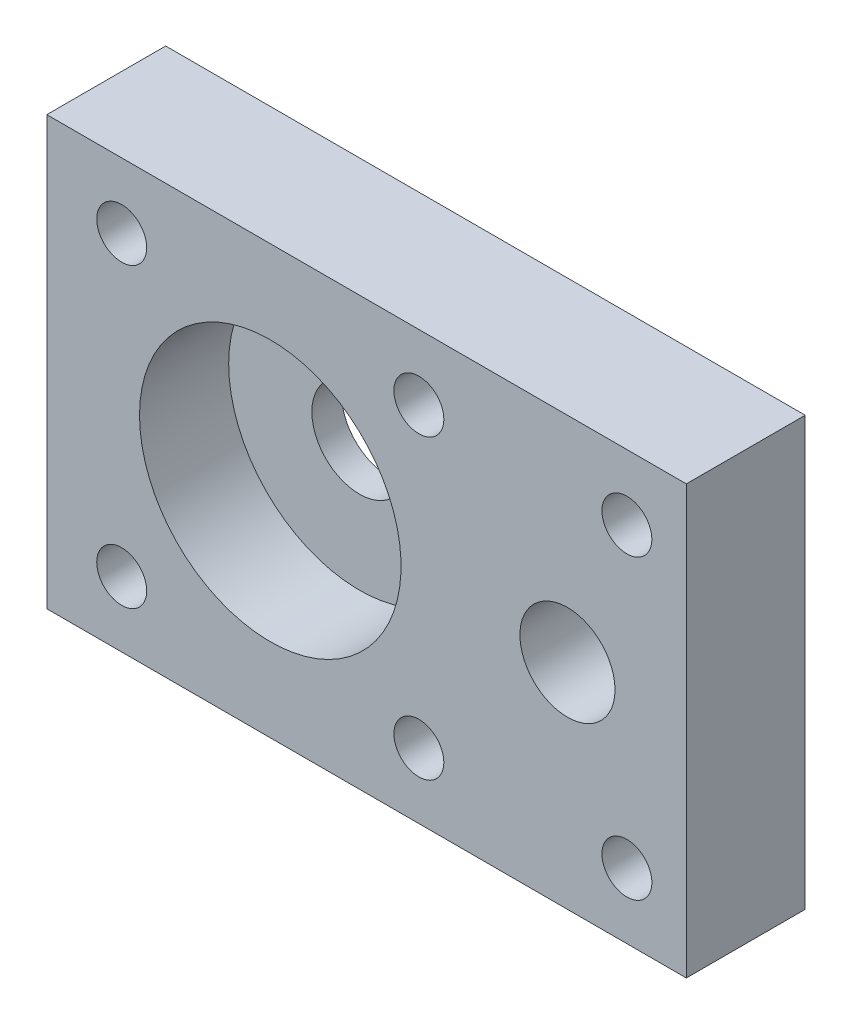
ISO-10303-21;
HEADER;
FILE_DESCRIPTION(('STEP AP214'),'2;1');
FILE_NAME('part.step','',(''),(''),'','','');
FILE_SCHEMA(('AUTOMOTIVE_DESIGN { 1 0 10303 214 1 1 1 1 }'));
ENDSEC;
DATA;
#1=APPLICATION_CONTEXT('core data for automotive mechanical design processes');
#2=APPLICATION_PROTOCOL_DEFINITION('international standard','automotive_design',2000,#1);
#3=PRODUCT_CONTEXT('',#1,'mechanical');
#4=PRODUCT('Part','Part','',(#3));
#5=PRODUCT_RELATED_PRODUCT_CATEGORY('part','',(#4));
#6=PRODUCT_DEFINITION_FORMATION('','',#4);
#7=PRODUCT_DEFINITION_CONTEXT('part definition',#1,'design');
#8=PRODUCT_DEFINITION('design','',#6,#7);
#9=PRODUCT_DEFINITION_SHAPE('','',#8);
#10=(LENGTH_UNIT() NAMED_UNIT(*) SI_UNIT(.MILLI.,.METRE.));
#11=(NAMED_UNIT(*) PLANE_ANGLE_UNIT() SI_UNIT($,.RADIAN.));
#12=(NAMED_UNIT(*) SI_UNIT($,.STERADIAN.) SOLID_ANGLE_UNIT());
#13=UNCERTAINTY_MEASURE_WITH_UNIT(LENGTH_MEASURE(1.E-05),#10,'distance_accuracy_value','');
#14=(GEOMETRIC_REPRESENTATION_CONTEXT(3) GLOBAL_UNCERTAINTY_ASSIGNED_CONTEXT((#13)) GLOBAL_UNIT_ASSIGNED_CONTEXT((#10,
#11,#12)) REPRESENTATION_CONTEXT('',''));
#15=CARTESIAN_POINT('',(0.,0.,0.));
#16=DIRECTION('',(0.,0.,1.));
#17=DIRECTION('',(1.,0.,0.));
#18=AXIS2_PLACEMENT_3D('',#15,#16,#17);
#19=CARTESIAN_POINT('',(0.,0.,-10.));
#20=DIRECTION('',(0.,0.,-1.));
#21=DIRECTION('',(1.,0.,0.));
#22=AXIS2_PLACEMENT_3D('',#19,#20,#21);
#23=PLANE('',#22);
#24=CARTESIAN_POINT('',(-9.99999999999931,20.,-10.));
#25=DIRECTION('',(0.,0.,1.));
#26=DIRECTION('',(1.,0.,0.));
#27=AXIS2_PLACEMENT_3D('',#24,#25,#26);
#28=CIRCLE('',#27,3.99999999999931);
#29=CARTESIAN_POINT('',(-6.,20.,-10.));
#30=VERTEX_POINT('',#29);
#31=EDGE_CURVE('E88',#30,#30,#28,.T.);
#32=ORIENTED_EDGE('',*,*,#31,.T.);
#33=EDGE_LOOP('',(#32));
#34=FACE_BOUND('',#33,.T.);
#35=CARTESIAN_POINT('',(-5.,7.49999999999999,-10.));
#36=DIRECTION('',(0.,0.,1.));
#37=DIRECTION('',(-1.,0.,0.));
#38=AXIS2_PLACEMENT_3D('',#35,#36,#37);
#39=CIRCLE('',#38,2.1);
#40=CARTESIAN_POINT('',(-7.09999999999999,7.49999999999999,-10.));
#41=VERTEX_POINT('',#40);
#42=EDGE_CURVE('E122',#41,#41,#39,.T.);
#43=ORIENTED_EDGE('',*,*,#42,.T.);
#44=EDGE_LOOP('',(#43));
#45=FACE_BOUND('',#44,.T.);
#46=CARTESIAN_POINT('',(-22.5,7.5,-10.));
#47=DIRECTION('',(0.,0.,1.));
#48=DIRECTION('',(1.,0.,0.));
#49=AXIS2_PLACEMENT_3D('',#46,#47,#48);
#50=CIRCLE('',#49,2.1);
#51=CARTESIAN_POINT('',(-20.4,7.5,-10.));
#52=VERTEX_POINT('',#51);
#53=EDGE_CURVE('E134',#52,#52,#50,.T.);
#54=ORIENTED_EDGE('',*,*,#53,.T.);
#55=EDGE_LOOP('',(#54));
#56=FACE_BOUND('',#55,.T.);
#57=CARTESIAN_POINT('',(-47.5,7.49999999999998,-10.));
#58=DIRECTION('',(0.,0.,1.));
#59=DIRECTION('',(-1.,0.,0.));
#60=AXIS2_PLACEMENT_3D('',#57,#58,#59);
#61=CIRCLE('',#60,2.1);
#62=CARTESIAN_POINT('',(-49.6,7.49999999999998,-10.));
#63=VERTEX_POINT('',#62);
#64=EDGE_CURVE('E146',#63,#63,#61,.T.);
#65=ORIENTED_EDGE('',*,*,#64,.T.);
#66=EDGE_LOOP('',(#65));
#67=FACE_BOUND('',#66,.T.);
#68=CARTESIAN_POINT('',(-22.5,32.5,-10.));
#69=DIRECTION('',(0.,0.,1.));
#70=DIRECTION('',(1.,0.,0.));
#71=AXIS2_PLACEMENT_3D('',#68,#69,#70);
#72=CIRCLE('',#71,2.1);
#73=CARTESIAN_POINT('',(-20.4,32.5,-10.));
#74=VERTEX_POINT('',#73);
#75=EDGE_CURVE('E96',#74,#74,#72,.T.);
#76=ORIENTED_EDGE('',*,*,#75,.T.);
#77=EDGE_LOOP('',(#76));
#78=FACE_BOUND('',#77,.T.);
#79=CARTESIAN_POINT('',(-47.5,32.5,-10.));
#80=DIRECTION('',(0.,0.,1.));
#81=DIRECTION('',(1.,0.,0.));
#82=AXIS2_PLACEMENT_3D('',#79,#80,#81);
#83=CIRCLE('',#82,2.1);
#84=CARTESIAN_POINT('',(-45.4,32.5,-10.));
#85=VERTEX_POINT('',#84);
#86=EDGE_CURVE('E140',#85,#85,#83,.T.);
#87=ORIENTED_EDGE('',*,*,#86,.T.);
#88=EDGE_LOOP('',(#87));
#89=FACE_BOUND('',#88,.T.);
#90=CARTESIAN_POINT('',(-5.,32.5,-10.));
#91=DIRECTION('',(0.,0.,1.));
#92=DIRECTION('',(1.,0.,0.));
#93=AXIS2_PLACEMENT_3D('',#90,#91,#92);
#94=CIRCLE('',#93,2.1);
#95=CARTESIAN_POINT('',(-2.9,32.5,-10.));
#96=VERTEX_POINT('',#95);
#97=EDGE_CURVE('E128',#96,#96,#94,.T.);
#98=ORIENTED_EDGE('',*,*,#97,.T.);
#99=EDGE_LOOP('',(#98));
#100=FACE_BOUND('',#99,.T.);
#101=CARTESIAN_POINT('',(-35.,20.,-10.));
#102=DIRECTION('',(0.,0.,1.));
#103=DIRECTION('',(1.,0.,0.));
#104=AXIS2_PLACEMENT_3D('',#101,#102,#103);
#105=CIRCLE('',#104,4.);
#106=CARTESIAN_POINT('',(-31.,20.,-10.));
#107=VERTEX_POINT('',#106);
#108=EDGE_CURVE('E118',#107,#107,#105,.T.);
#109=ORIENTED_EDGE('',*,*,#108,.T.);
#110=EDGE_LOOP('',(#109));
#111=FACE_BOUND('',#110,.T.);
#112=DIRECTION('',(0.,1.,0.));
#113=VECTOR('',#112,1.);
#114=CARTESIAN_POINT('',(0.,0.,-10.));
#115=LINE('',#114,#113);
#116=CARTESIAN_POINT('',(0.,2.,-10.));
#117=VERTEX_POINT('',#116);
#118=CARTESIAN_POINT('',(0.,38.,-10.));
#119=VERTEX_POINT('',#118);
#120=EDGE_CURVE('E46',#117,#119,#115,.T.);
#121=ORIENTED_EDGE('',*,*,#120,.F.);
#122=DIRECTION('',(-1.,0.,0.));
#123=VECTOR('',#122,1.);
#124=CARTESIAN_POINT('',(0.,2.,-10.));
#125=LINE('',#124,#123);
#126=CARTESIAN_POINT('',(-53.8,2.,-10.));
#127=VERTEX_POINT('',#126);
#128=EDGE_CURVE('E109',#117,#127,#125,.T.);
#129=ORIENTED_EDGE('',*,*,#128,.T.);
#130=DIRECTION('',(0.,-1.,0.));
#131=VECTOR('',#130,1.);
#132=CARTESIAN_POINT('',(-53.8,0.,-10.));
#133=LINE('',#132,#131);
#134=CARTESIAN_POINT('',(-53.8,38.,-10.));
#135=VERTEX_POINT('',#134);
#136=EDGE_CURVE('E11',#135,#127,#133,.T.);
#137=ORIENTED_EDGE('',*,*,#136,.F.);
#138=DIRECTION('',(1.,0.,0.));
#139=VECTOR('',#138,1.);
#140=CARTESIAN_POINT('',(-53.8,38.,-10.));
#141=LINE('',#140,#139);
#142=EDGE_CURVE('E100',#135,#119,#141,.T.);
#143=ORIENTED_EDGE('',*,*,#142,.T.);
#144=EDGE_LOOP('',(#121,#129,#137,#143));
#145=FACE_BOUND('',#144,.T.);
#146=ADVANCED_FACE('F37',(#34,#45,#56,#67,#78,#89,#100,#111,#145),#23,.T.);
#147=CARTESIAN_POINT('',(0.,0.,0.));
#148=DIRECTION('',(0.,0.,-1.));
#149=DIRECTION('',(1.,0.,0.));
#150=AXIS2_PLACEMENT_3D('',#147,#148,#149);
#151=PLANE('',#150);
#152=CARTESIAN_POINT('',(-9.99999999999931,20.,0.));
#153=DIRECTION('',(0.,0.,1.));
#154=DIRECTION('',(1.,0.,0.));
#155=AXIS2_PLACEMENT_3D('',#152,#153,#154);
#156=CIRCLE('',#155,3.99999999999931);
#157=CARTESIAN_POINT('',(-6.,20.,0.));
#158=VERTEX_POINT('',#157);
#159=EDGE_CURVE('E352',#158,#158,#156,.T.);
#160=ORIENTED_EDGE('',*,*,#159,.F.);
#161=EDGE_LOOP('',(#160));
#162=FACE_BOUND('',#161,.T.);
#163=CARTESIAN_POINT('',(-34.9999999999993,19.9999999999776,0.));
#164=DIRECTION('',(0.,0.,-1.));
#165=DIRECTION('',(-1.,0.,0.));
#166=AXIS2_PLACEMENT_3D('',#163,#164,#165);
#167=CIRCLE('',#166,11.0000000000071);
#168=CARTESIAN_POINT('',(-46.0000000000064,19.9999999999776,0.));
#169=VERTEX_POINT('',#168);
#170=EDGE_CURVE('E112',#169,#169,#167,.T.);
#171=ORIENTED_EDGE('',*,*,#170,.T.);
#172=EDGE_LOOP('',(#171));
#173=FACE_BOUND('',#172,.T.);
#174=CARTESIAN_POINT('',(-22.5,32.5,0.));
#175=DIRECTION('',(0.,0.,1.));
#176=DIRECTION('',(1.,0.,0.));
#177=AXIS2_PLACEMENT_3D('',#174,#175,#176);
#178=CIRCLE('',#177,2.1);
#179=CARTESIAN_POINT('',(-20.4,32.5,0.));
#180=VERTEX_POINT('',#179);
#181=EDGE_CURVE('E149',#180,#180,#178,.T.);
#182=ORIENTED_EDGE('',*,*,#181,.F.);
#183=EDGE_LOOP('',(#182));
#184=FACE_BOUND('',#183,.T.);
#185=CARTESIAN_POINT('',(-47.5,7.49999999999998,0.));
#186=DIRECTION('',(0.,0.,1.));
#187=DIRECTION('',(-1.,0.,0.));
#188=AXIS2_PLACEMENT_3D('',#185,#186,#187);
#189=CIRCLE('',#188,2.1);
#190=CARTESIAN_POINT('',(-49.6,7.49999999999998,0.));
#191=VERTEX_POINT('',#190);
#192=EDGE_CURVE('E143',#191,#191,#189,.T.);
#193=ORIENTED_EDGE('',*,*,#192,.F.);
#194=EDGE_LOOP('',(#193));
#195=FACE_BOUND('',#194,.T.);
#196=CARTESIAN_POINT('',(-47.5,32.5,0.));
#197=DIRECTION('',(0.,0.,1.));
#198=DIRECTION('',(1.,0.,0.));
#199=AXIS2_PLACEMENT_3D('',#196,#197,#198);
#200=CIRCLE('',#199,2.1);
#201=CARTESIAN_POINT('',(-45.4,32.5,0.));
#202=VERTEX_POINT('',#201);
#203=EDGE_CURVE('E137',#202,#202,#200,.T.);
#204=ORIENTED_EDGE('',*,*,#203,.F.);
#205=EDGE_LOOP('',(#204));
#206=FACE_BOUND('',#205,.T.);
#207=CARTESIAN_POINT('',(-22.5,7.5,0.));
#208=DIRECTION('',(0.,0.,1.));
#209=DIRECTION('',(1.,0.,0.));
#210=AXIS2_PLACEMENT_3D('',#207,#208,#209);
#211=CIRCLE('',#210,2.1);
#212=CARTESIAN_POINT('',(-20.4,7.5,0.));
#213=VERTEX_POINT('',#212);
#214=EDGE_CURVE('E131',#213,#213,#211,.T.);
#215=ORIENTED_EDGE('',*,*,#214,.F.);
#216=EDGE_LOOP('',(#215));
#217=FACE_BOUND('',#216,.T.);
#218=CARTESIAN_POINT('',(-5.,32.5,0.));
#219=DIRECTION('',(0.,0.,1.));
#220=DIRECTION('',(1.,0.,0.));
#221=AXIS2_PLACEMENT_3D('',#218,#219,#220);
#222=CIRCLE('',#221,2.1);
#223=CARTESIAN_POINT('',(-2.9,32.5,0.));
#224=VERTEX_POINT('',#223);
#225=EDGE_CURVE('E125',#224,#224,#222,.T.);
#226=ORIENTED_EDGE('',*,*,#225,.F.);
#227=EDGE_LOOP('',(#226));
#228=FACE_BOUND('',#227,.T.);
#229=CARTESIAN_POINT('',(-5.,7.49999999999999,0.));
#230=DIRECTION('',(0.,0.,1.));
#231=DIRECTION('',(-1.,0.,0.));
#232=AXIS2_PLACEMENT_3D('',#229,#230,#231);
#233=CIRCLE('',#232,2.1);
#234=CARTESIAN_POINT('',(-7.09999999999999,7.49999999999999,0.));
#235=VERTEX_POINT('',#234);
#236=EDGE_CURVE('E121',#235,#235,#233,.T.);
#237=ORIENTED_EDGE('',*,*,#236,.F.);
#238=EDGE_LOOP('',(#237));
#239=FACE_BOUND('',#238,.T.);
#240=DIRECTION('',(-1.,0.,0.));
#241=VECTOR('',#240,1.);
#242=CARTESIAN_POINT('',(0.,38.,0.));
#243=LINE('',#242,#241);
#244=CARTESIAN_POINT('',(0.,38.,0.));
#245=VERTEX_POINT('',#244);
#246=CARTESIAN_POINT('',(-53.8,38.,0.));
#247=VERTEX_POINT('',#246);
#248=EDGE_CURVE('E87',#245,#247,#243,.T.);
#249=ORIENTED_EDGE('',*,*,#248,.T.);
#250=DIRECTION('',(0.,-1.,0.));
#251=VECTOR('',#250,1.);
#252=CARTESIAN_POINT('',(-53.8,0.,0.));
#253=LINE('',#252,#251);
#254=CARTESIAN_POINT('',(-53.8,2.,0.));
#255=VERTEX_POINT('',#254);
#256=EDGE_CURVE('E95',#247,#255,#253,.T.);
#257=ORIENTED_EDGE('',*,*,#256,.T.);
#258=DIRECTION('',(1.,0.,0.));
#259=VECTOR('',#258,1.);
#260=CARTESIAN_POINT('',(-53.8,2.,0.));
#261=LINE('',#260,#259);
#262=CARTESIAN_POINT('',(0.,2.,0.));
#263=VERTEX_POINT('',#262);
#264=EDGE_CURVE('E94',#255,#263,#261,.T.);
#265=ORIENTED_EDGE('',*,*,#264,.T.);
#266=DIRECTION('',(0.,1.,0.));
#267=VECTOR('',#266,1.);
#268=CARTESIAN_POINT('',(0.,0.,0.));
#269=LINE('',#268,#267);
#270=EDGE_CURVE('E83',#263,#245,#269,.T.);
#271=ORIENTED_EDGE('',*,*,#270,.T.);
#272=EDGE_LOOP('',(#249,#257,#265,#271));
#273=FACE_BOUND('',#272,.T.);
#274=ADVANCED_FACE('F92',(#162,#173,#184,#195,#206,#217,#228,#239,#273),#151,.F.);
#275=CARTESIAN_POINT('',(0.,0.,-10.));
#276=DIRECTION('',(-1.,0.,0.));
#277=DIRECTION('',(0.,0.,-1.));
#278=AXIS2_PLACEMENT_3D('',#275,#276,#277);
#279=PLANE('',#278);
#280=DIRECTION('',(0.,0.,1.));
#281=VECTOR('',#280,1.);
#282=CARTESIAN_POINT('',(0.,38.,-10.));
#283=LINE('',#282,#281);
#284=EDGE_CURVE('E81',#119,#245,#283,.T.);
#285=ORIENTED_EDGE('',*,*,#284,.T.);
#286=ORIENTED_EDGE('',*,*,#270,.F.);
#287=DIRECTION('',(0.,0.,-1.));
#288=VECTOR('',#287,1.);
#289=CARTESIAN_POINT('',(0.,2.,0.));
#290=LINE('',#289,#288);
#291=EDGE_CURVE('E107',#263,#117,#290,.T.);
#292=ORIENTED_EDGE('',*,*,#291,.T.);
#293=ORIENTED_EDGE('',*,*,#120,.T.);
#294=EDGE_LOOP('',(#285,#286,#292,#293));
#295=FACE_BOUND('',#294,.T.);
#296=ADVANCED_FACE('F39',(#295),#279,.F.);
#297=CARTESIAN_POINT('',(-53.8,0.,-10.));
#298=DIRECTION('',(1.,0.,0.));
#299=DIRECTION('',(0.,0.,1.));
#300=AXIS2_PLACEMENT_3D('',#297,#298,#299);
#301=PLANE('',#300);
#302=DIRECTION('',(0.,0.,-1.));
#303=VECTOR('',#302,1.);
#304=CARTESIAN_POINT('',(-53.8,38.,0.));
#305=LINE('',#304,#303);
#306=EDGE_CURVE('E54',#247,#135,#305,.T.);
#307=ORIENTED_EDGE('',*,*,#306,.T.);
#308=ORIENTED_EDGE('',*,*,#136,.T.);
#309=DIRECTION('',(0.,0.,1.));
#310=VECTOR('',#309,1.);
#311=CARTESIAN_POINT('',(-53.8,2.,-10.));
#312=LINE('',#311,#310);
#313=EDGE_CURVE('E62',#127,#255,#312,.T.);
#314=ORIENTED_EDGE('',*,*,#313,.T.);
#315=ORIENTED_EDGE('',*,*,#256,.F.);
#316=EDGE_LOOP('',(#307,#308,#314,#315));
#317=FACE_BOUND('',#316,.T.);
#318=ADVANCED_FACE('F157',(#317),#301,.F.);
#319=CARTESIAN_POINT('',(-35.,20.,-10.));
#320=DIRECTION('',(0.,0.,1.));
#321=DIRECTION('',(-1.,0.,0.));
#322=AXIS2_PLACEMENT_3D('',#319,#320,#321);
#323=CYLINDRICAL_SURFACE('',#322,4.);
#324=ORIENTED_EDGE('',*,*,#108,.F.);
#325=EDGE_LOOP('',(#324));
#326=FACE_BOUND('',#325,.T.);
#327=CARTESIAN_POINT('',(-35.,20.,-7.5));
#328=DIRECTION('',(0.,0.,-1.));
#329=DIRECTION('',(-1.,0.,0.));
#330=AXIS2_PLACEMENT_3D('',#327,#328,#329);
#331=CIRCLE('',#330,4.);
#332=CARTESIAN_POINT('',(-39.,20.,-7.5));
#333=VERTEX_POINT('',#332);
#334=EDGE_CURVE('E41',#333,#333,#331,.T.);
#335=ORIENTED_EDGE('',*,*,#334,.F.);
#336=EDGE_LOOP('',(#335));
#337=FACE_BOUND('',#336,.T.);
#338=ADVANCED_FACE('F175',(#326,#337),#323,.F.);
#339=CARTESIAN_POINT('',(-22.5,32.5,-10.));
#340=DIRECTION('',(0.,0.,1.));
#341=DIRECTION('',(-1.,0.,0.));
#342=AXIS2_PLACEMENT_3D('',#339,#340,#341);
#343=CYLINDRICAL_SURFACE('',#342,2.1);
#344=ORIENTED_EDGE('',*,*,#75,.F.);
#345=EDGE_LOOP('',(#344));
#346=FACE_BOUND('',#345,.T.);
#347=ORIENTED_EDGE('',*,*,#181,.T.);
#348=EDGE_LOOP('',(#347));
#349=FACE_BOUND('',#348,.T.);
#350=ADVANCED_FACE('F172',(#346,#349),#343,.F.);
#351=CARTESIAN_POINT('',(-47.5,7.49999999999998,-10.));
#352=DIRECTION('',(0.,0.,1.));
#353=DIRECTION('',(-1.,0.,0.));
#354=AXIS2_PLACEMENT_3D('',#351,#352,#353);
#355=CYLINDRICAL_SURFACE('',#354,2.1);
#356=ORIENTED_EDGE('',*,*,#64,.F.);
#357=EDGE_LOOP('',(#356));
#358=FACE_BOUND('',#357,.T.);
#359=ORIENTED_EDGE('',*,*,#192,.T.);
#360=EDGE_LOOP('',(#359));
#361=FACE_BOUND('',#360,.T.);
#362=ADVANCED_FACE('F261',(#358,#361),#355,.F.);
#363=CARTESIAN_POINT('',(-47.5,32.5,-10.));
#364=DIRECTION('',(0.,0.,1.));
#365=DIRECTION('',(-1.,0.,0.));
#366=AXIS2_PLACEMENT_3D('',#363,#364,#365);
#367=CYLINDRICAL_SURFACE('',#366,2.1);
#368=ORIENTED_EDGE('',*,*,#86,.F.);
#369=EDGE_LOOP('',(#368));
#370=FACE_BOUND('',#369,.T.);
#371=ORIENTED_EDGE('',*,*,#203,.T.);
#372=EDGE_LOOP('',(#371));
#373=FACE_BOUND('',#372,.T.);
#374=ADVANCED_FACE('F253',(#370,#373),#367,.F.);
#375=CARTESIAN_POINT('',(-22.5,7.5,-10.));
#376=DIRECTION('',(0.,0.,1.));
#377=DIRECTION('',(-1.,0.,0.));
#378=AXIS2_PLACEMENT_3D('',#375,#376,#377);
#379=CYLINDRICAL_SURFACE('',#378,2.1);
#380=ORIENTED_EDGE('',*,*,#53,.F.);
#381=EDGE_LOOP('',(#380));
#382=FACE_BOUND('',#381,.T.);
#383=ORIENTED_EDGE('',*,*,#214,.T.);
#384=EDGE_LOOP('',(#383));
#385=FACE_BOUND('',#384,.T.);
#386=ADVANCED_FACE('F245',(#382,#385),#379,.F.);
#387=CARTESIAN_POINT('',(-5.,32.5,-10.));
#388=DIRECTION('',(0.,0.,1.));
#389=DIRECTION('',(-1.,0.,0.));
#390=AXIS2_PLACEMENT_3D('',#387,#388,#389);
#391=CYLINDRICAL_SURFACE('',#390,2.1);
#392=ORIENTED_EDGE('',*,*,#97,.F.);
#393=EDGE_LOOP('',(#392));
#394=FACE_BOUND('',#393,.T.);
#395=ORIENTED_EDGE('',*,*,#225,.T.);
#396=EDGE_LOOP('',(#395));
#397=FACE_BOUND('',#396,.T.);
#398=ADVANCED_FACE('F237',(#394,#397),#391,.F.);
#399=CARTESIAN_POINT('',(-5.,7.49999999999999,-10.));
#400=DIRECTION('',(0.,0.,1.));
#401=DIRECTION('',(-1.,0.,0.));
#402=AXIS2_PLACEMENT_3D('',#399,#400,#401);
#403=CYLINDRICAL_SURFACE('',#402,2.1);
#404=ORIENTED_EDGE('',*,*,#42,.F.);
#405=EDGE_LOOP('',(#404));
#406=FACE_BOUND('',#405,.T.);
#407=ORIENTED_EDGE('',*,*,#236,.T.);
#408=EDGE_LOOP('',(#407));
#409=FACE_BOUND('',#408,.T.);
#410=ADVANCED_FACE('F229',(#406,#409),#403,.F.);
#411=CARTESIAN_POINT('',(-34.9999999999993,19.9999999999776,-7.5));
#412=DIRECTION('',(0.,0.,1.));
#413=DIRECTION('',(-1.,0.,0.));
#414=AXIS2_PLACEMENT_3D('',#411,#412,#413);
#415=CYLINDRICAL_SURFACE('',#414,11.0000000000071);
#416=CARTESIAN_POINT('',(-34.9999999999993,19.9999999999776,-7.5));
#417=DIRECTION('',(0.,0.,-1.));
#418=DIRECTION('',(-1.,0.,0.));
#419=AXIS2_PLACEMENT_3D('',#416,#417,#418);
#420=CIRCLE('',#419,11.0000000000071);
#421=CARTESIAN_POINT('',(-46.0000000000064,19.9999999999776,-7.5));
#422=VERTEX_POINT('',#421);
#423=EDGE_CURVE('E113',#422,#422,#420,.T.);
#424=ORIENTED_EDGE('',*,*,#423,.T.);
#425=EDGE_LOOP('',(#424));
#426=FACE_BOUND('',#425,.T.);
#427=ORIENTED_EDGE('',*,*,#170,.F.);
#428=EDGE_LOOP('',(#427));
#429=FACE_BOUND('',#428,.T.);
#430=ADVANCED_FACE('F221',(#426,#429),#415,.F.);
#431=CARTESIAN_POINT('',(-34.9999999999993,19.9999999999776,-7.5));
#432=DIRECTION('',(0.,0.,1.));
#433=DIRECTION('',(-1.,0.,0.));
#434=AXIS2_PLACEMENT_3D('',#431,#432,#433);
#435=PLANE('',#434);
#436=ORIENTED_EDGE('',*,*,#334,.T.);
#437=EDGE_LOOP('',(#436));
#438=FACE_BOUND('',#437,.T.);
#439=ORIENTED_EDGE('',*,*,#423,.F.);
#440=EDGE_LOOP('',(#439));
#441=FACE_BOUND('',#440,.T.);
#442=ADVANCED_FACE('F214',(#438,#441),#435,.T.);
#443=CARTESIAN_POINT('',(0.,2.,0.));
#444=DIRECTION('',(0.,-1.,0.));
#445=DIRECTION('',(0.,0.,1.));
#446=AXIS2_PLACEMENT_3D('',#443,#444,#445);
#447=PLANE('',#446);
#448=ORIENTED_EDGE('',*,*,#313,.F.);
#449=ORIENTED_EDGE('',*,*,#128,.F.);
#450=ORIENTED_EDGE('',*,*,#291,.F.);
#451=ORIENTED_EDGE('',*,*,#264,.F.);
#452=EDGE_LOOP('',(#448,#449,#450,#451));
#453=FACE_BOUND('',#452,.T.);
#454=ADVANCED_FACE('F159',(#453),#447,.T.);
#455=CARTESIAN_POINT('',(0.,38.,0.));
#456=DIRECTION('',(0.,1.,0.));
#457=DIRECTION('',(-1.,0.,0.));
#458=AXIS2_PLACEMENT_3D('',#455,#456,#457);
#459=PLANE('',#458);
#460=ORIENTED_EDGE('',*,*,#284,.F.);
#461=ORIENTED_EDGE('',*,*,#142,.F.);
#462=ORIENTED_EDGE('',*,*,#306,.F.);
#463=ORIENTED_EDGE('',*,*,#248,.F.);
#464=EDGE_LOOP('',(#460,#461,#462,#463));
#465=FACE_BOUND('',#464,.T.);
#466=ADVANCED_FACE('F98',(#465),#459,.T.);
#467=CARTESIAN_POINT('',(-9.99999999999931,20.,-10.));
#468=DIRECTION('',(0.,0.,1.));
#469=DIRECTION('',(1.,0.,0.));
#470=AXIS2_PLACEMENT_3D('',#467,#468,#469);
#471=CYLINDRICAL_SURFACE('',#470,3.99999999999931);
#472=ORIENTED_EDGE('',*,*,#31,.F.);
#473=EDGE_LOOP('',(#472));
#474=FACE_BOUND('',#473,.T.);
#475=ORIENTED_EDGE('',*,*,#159,.T.);
#476=EDGE_LOOP('',(#475));
#477=FACE_BOUND('',#476,.T.);
#478=ADVANCED_FACE('F196',(#474,#477),#471,.F.);
#479=CLOSED_SHELL('',(#146,#274,#296,#318,#338,#350,#362,#374,#386,#398,#410,#430,#442,#454,
#466,#478));
#480=MANIFOLD_SOLID_BREP('B2',#479);
#481=ADVANCED_BREP_SHAPE_REPRESENTATION('',(#18,#480),#14);
#482=SHAPE_DEFINITION_REPRESENTATION(#9,#481);
ENDSEC;
END-ISO-10303-21;
